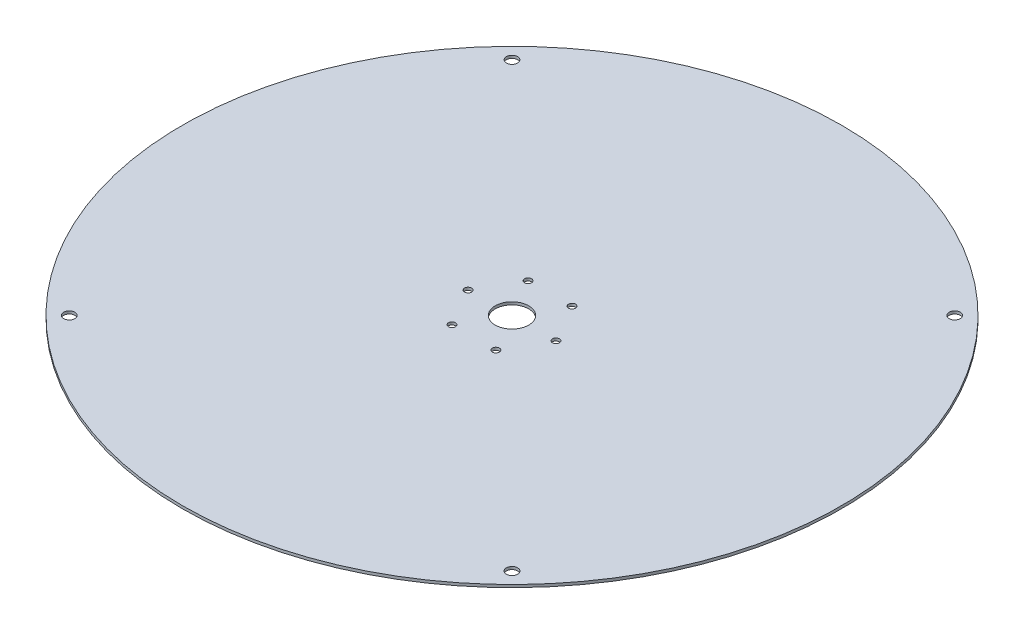
ISO-10303-21;
HEADER;
FILE_DESCRIPTION(('STEP AP214'),'2;1');
FILE_NAME('part.step','',(''),(''),'','','');
FILE_SCHEMA(('AUTOMOTIVE_DESIGN { 1 0 10303 214 1 1 1 1 }'));
ENDSEC;
DATA;
#1=APPLICATION_CONTEXT('core data for automotive mechanical design processes');
#2=APPLICATION_PROTOCOL_DEFINITION('international standard','automotive_design',2000,#1);
#3=PRODUCT_CONTEXT('',#1,'mechanical');
#4=PRODUCT('Part','Part','',(#3));
#5=PRODUCT_RELATED_PRODUCT_CATEGORY('part','',(#4));
#6=PRODUCT_DEFINITION_FORMATION('','',#4);
#7=PRODUCT_DEFINITION_CONTEXT('part definition',#1,'design');
#8=PRODUCT_DEFINITION('design','',#6,#7);
#9=PRODUCT_DEFINITION_SHAPE('','',#8);
#10=(LENGTH_UNIT() NAMED_UNIT(*) SI_UNIT(.MILLI.,.METRE.));
#11=(NAMED_UNIT(*) PLANE_ANGLE_UNIT() SI_UNIT($,.RADIAN.));
#12=(NAMED_UNIT(*) SI_UNIT($,.STERADIAN.) SOLID_ANGLE_UNIT());
#13=UNCERTAINTY_MEASURE_WITH_UNIT(LENGTH_MEASURE(1.E-05),#10,'distance_accuracy_value','');
#14=(GEOMETRIC_REPRESENTATION_CONTEXT(3) GLOBAL_UNCERTAINTY_ASSIGNED_CONTEXT((#13)) GLOBAL_UNIT_ASSIGNED_CONTEXT((#10,
#11,#12)) REPRESENTATION_CONTEXT('',''));
#15=CARTESIAN_POINT('',(0.,0.,0.));
#16=DIRECTION('',(0.,0.,1.));
#17=DIRECTION('',(1.,0.,0.));
#18=AXIS2_PLACEMENT_3D('',#15,#16,#17);
#19=CARTESIAN_POINT('',(0.,3.1,0.));
#20=DIRECTION('',(0.,-1.,0.));
#21=DIRECTION('',(0.,0.,-1.));
#22=AXIS2_PLACEMENT_3D('',#19,#20,#21);
#23=CYLINDRICAL_SURFACE('',#22,375.);
#24=CARTESIAN_POINT('',(0.,3.1,0.));
#25=DIRECTION('',(0.,1.,0.));
#26=DIRECTION('',(0.,0.,1.));
#27=AXIS2_PLACEMENT_3D('',#24,#25,#26);
#28=CIRCLE('',#27,375.);
#29=CARTESIAN_POINT('',(0.,3.1,375.));
#30=VERTEX_POINT('',#29);
#31=EDGE_CURVE('E10',#30,#30,#28,.T.);
#32=ORIENTED_EDGE('',*,*,#31,.F.);
#33=EDGE_LOOP('',(#32));
#34=FACE_BOUND('',#33,.T.);
#35=CARTESIAN_POINT('',(0.,0.,0.));
#36=DIRECTION('',(0.,1.,0.));
#37=DIRECTION('',(0.,0.,1.));
#38=AXIS2_PLACEMENT_3D('',#35,#36,#37);
#39=CIRCLE('',#38,375.);
#40=CARTESIAN_POINT('',(0.,0.,375.));
#41=VERTEX_POINT('',#40);
#42=EDGE_CURVE('E46',#41,#41,#39,.T.);
#43=ORIENTED_EDGE('',*,*,#42,.T.);
#44=EDGE_LOOP('',(#43));
#45=FACE_BOUND('',#44,.T.);
#46=ADVANCED_FACE('F43',(#34,#45),#23,.T.);
#47=CARTESIAN_POINT('',(0.,3.1,0.));
#48=DIRECTION('',(0.,1.,0.));
#49=DIRECTION('',(0.,0.,1.));
#50=AXIS2_PLACEMENT_3D('',#47,#48,#49);
#51=PLANE('',#50);
#52=CARTESIAN_POINT('',(50.,3.1,0.));
#53=DIRECTION('',(0.,1.,0.));
#54=DIRECTION('',(0.,0.,1.));
#55=AXIS2_PLACEMENT_3D('',#52,#53,#54);
#56=CIRCLE('',#55,4.00000000000001);
#57=CARTESIAN_POINT('',(50.,3.1,4.00000000000001));
#58=VERTEX_POINT('',#57);
#59=EDGE_CURVE('E130',#58,#58,#56,.T.);
#60=ORIENTED_EDGE('',*,*,#59,.F.);
#61=EDGE_LOOP('',(#60));
#62=FACE_BOUND('',#61,.T.);
#63=CARTESIAN_POINT('',(25.0000000000005,3.1,-43.3012701892216));
#64=DIRECTION('',(0.,1.,0.));
#65=DIRECTION('',(0.,0.,1.));
#66=AXIS2_PLACEMENT_3D('',#63,#64,#65);
#67=CIRCLE('',#66,4.00000000000001);
#68=CARTESIAN_POINT('',(25.0000000000005,3.1,-39.3012701892216));
#69=VERTEX_POINT('',#68);
#70=EDGE_CURVE('E102',#69,#69,#67,.T.);
#71=ORIENTED_EDGE('',*,*,#70,.F.);
#72=EDGE_LOOP('',(#71));
#73=FACE_BOUND('',#72,.T.);
#74=CARTESIAN_POINT('',(-24.9999999999996,3.1,-43.3012701892222));
#75=DIRECTION('',(0.,1.,0.));
#76=DIRECTION('',(0.,0.,1.));
#77=AXIS2_PLACEMENT_3D('',#74,#75,#76);
#78=CIRCLE('',#77,4.);
#79=CARTESIAN_POINT('',(-24.9999999999996,3.1,-39.3012701892222));
#80=VERTEX_POINT('',#79);
#81=EDGE_CURVE('E101',#80,#80,#78,.T.);
#82=ORIENTED_EDGE('',*,*,#81,.F.);
#83=EDGE_LOOP('',(#82));
#84=FACE_BOUND('',#83,.T.);
#85=CARTESIAN_POINT('',(-50.,3.1,-3.49148133884313E-13));
#86=DIRECTION('',(0.,1.,0.));
#87=DIRECTION('',(0.,0.,1.));
#88=AXIS2_PLACEMENT_3D('',#85,#86,#87);
#89=CIRCLE('',#88,4.00000000000001);
#90=CARTESIAN_POINT('',(-50.,3.1,3.99999999999966));
#91=VERTEX_POINT('',#90);
#92=EDGE_CURVE('E110',#91,#91,#89,.T.);
#93=ORIENTED_EDGE('',*,*,#92,.F.);
#94=EDGE_LOOP('',(#93));
#95=FACE_BOUND('',#94,.T.);
#96=CARTESIAN_POINT('',(-25.0000000000002,3.1,43.3012701892218));
#97=DIRECTION('',(0.,1.,0.));
#98=DIRECTION('',(0.,0.,1.));
#99=AXIS2_PLACEMENT_3D('',#96,#97,#98);
#100=CIRCLE('',#99,4.00000000000001);
#101=CARTESIAN_POINT('',(-25.0000000000002,3.1,47.3012701892218));
#102=VERTEX_POINT('',#101);
#103=EDGE_CURVE('E118',#102,#102,#100,.T.);
#104=ORIENTED_EDGE('',*,*,#103,.F.);
#105=EDGE_LOOP('',(#104));
#106=FACE_BOUND('',#105,.T.);
#107=CARTESIAN_POINT('',(24.9999999999999,3.1,43.301270189222));
#108=DIRECTION('',(0.,1.,0.));
#109=DIRECTION('',(0.,0.,1.));
#110=AXIS2_PLACEMENT_3D('',#107,#108,#109);
#111=CIRCLE('',#110,4.00000000000001);
#112=CARTESIAN_POINT('',(24.9999999999999,3.1,47.301270189222));
#113=VERTEX_POINT('',#112);
#114=EDGE_CURVE('E126',#113,#113,#111,.T.);
#115=ORIENTED_EDGE('',*,*,#114,.F.);
#116=EDGE_LOOP('',(#115));
#117=FACE_BOUND('',#116,.T.);
#118=CARTESIAN_POINT('',(251.871435458645,3.1,251.871435458651));
#119=DIRECTION('',(0.,1.,0.));
#120=DIRECTION('',(0.,0.,1.));
#121=AXIS2_PLACEMENT_3D('',#118,#119,#120);
#122=CIRCLE('',#121,6.35000000000001);
#123=CARTESIAN_POINT('',(251.871435458645,3.1,258.221435458651));
#124=VERTEX_POINT('',#123);
#125=EDGE_CURVE('E69',#124,#124,#122,.T.);
#126=ORIENTED_EDGE('',*,*,#125,.F.);
#127=EDGE_LOOP('',(#126));
#128=FACE_BOUND('',#127,.T.);
#129=CARTESIAN_POINT('',(251.87143545865,3.1,-251.871435458646));
#130=DIRECTION('',(0.,1.,0.));
#131=DIRECTION('',(0.,0.,1.));
#132=AXIS2_PLACEMENT_3D('',#129,#130,#131);
#133=CIRCLE('',#132,6.35);
#134=CARTESIAN_POINT('',(251.87143545865,3.1,-245.521435458646));
#135=VERTEX_POINT('',#134);
#136=EDGE_CURVE('E78',#135,#135,#133,.T.);
#137=ORIENTED_EDGE('',*,*,#136,.F.);
#138=EDGE_LOOP('',(#137));
#139=FACE_BOUND('',#138,.T.);
#140=CARTESIAN_POINT('',(-251.871435458647,3.1,-251.87143545865));
#141=DIRECTION('',(0.,1.,0.));
#142=DIRECTION('',(0.,0.,1.));
#143=AXIS2_PLACEMENT_3D('',#140,#141,#142);
#144=CIRCLE('',#143,6.34999999999998);
#145=CARTESIAN_POINT('',(-251.871435458647,3.1,-245.52143545865));
#146=VERTEX_POINT('',#145);
#147=EDGE_CURVE('E86',#146,#146,#144,.T.);
#148=ORIENTED_EDGE('',*,*,#147,.F.);
#149=EDGE_LOOP('',(#148));
#150=FACE_BOUND('',#149,.T.);
#151=CARTESIAN_POINT('',(0.,3.1,0.));
#152=DIRECTION('',(0.,1.,0.));
#153=DIRECTION('',(0.,0.,1.));
#154=AXIS2_PLACEMENT_3D('',#151,#152,#153);
#155=CIRCLE('',#154,19.05);
#156=CARTESIAN_POINT('',(0.,3.1,19.05));
#157=VERTEX_POINT('',#156);
#158=EDGE_CURVE('E61',#157,#157,#155,.T.);
#159=ORIENTED_EDGE('',*,*,#158,.F.);
#160=EDGE_LOOP('',(#159));
#161=FACE_BOUND('',#160,.T.);
#162=CARTESIAN_POINT('',(-251.871435458649,3.1,251.871435458648));
#163=DIRECTION('',(0.,1.,0.));
#164=DIRECTION('',(0.,0.,1.));
#165=AXIS2_PLACEMENT_3D('',#162,#163,#164);
#166=CIRCLE('',#165,6.34999999999999);
#167=CARTESIAN_POINT('',(-251.871435458649,3.1,258.221435458648));
#168=VERTEX_POINT('',#167);
#169=EDGE_CURVE('E57',#168,#168,#166,.T.);
#170=ORIENTED_EDGE('',*,*,#169,.F.);
#171=EDGE_LOOP('',(#170));
#172=FACE_BOUND('',#171,.T.);
#173=ORIENTED_EDGE('',*,*,#31,.T.);
#174=EDGE_LOOP('',(#173));
#175=FACE_BOUND('',#174,.T.);
#176=ADVANCED_FACE('F155',(#62,#73,#84,#95,#106,#117,#128,#139,#150,#161,#172,#175),#51,.T.);
#177=CARTESIAN_POINT('',(0.,0.,0.));
#178=DIRECTION('',(0.,1.,0.));
#179=DIRECTION('',(0.,0.,1.));
#180=AXIS2_PLACEMENT_3D('',#177,#178,#179);
#181=PLANE('',#180);
#182=CARTESIAN_POINT('',(50.,0.,0.));
#183=DIRECTION('',(0.,1.,0.));
#184=DIRECTION('',(0.,0.,1.));
#185=AXIS2_PLACEMENT_3D('',#182,#183,#184);
#186=CIRCLE('',#185,4.00000000000001);
#187=CARTESIAN_POINT('',(50.,0.,4.00000000000001));
#188=VERTEX_POINT('',#187);
#189=EDGE_CURVE('E70',#188,#188,#186,.T.);
#190=ORIENTED_EDGE('',*,*,#189,.T.);
#191=EDGE_LOOP('',(#190));
#192=FACE_BOUND('',#191,.T.);
#193=CARTESIAN_POINT('',(25.0000000000005,0.,-43.3012701892216));
#194=DIRECTION('',(0.,1.,0.));
#195=DIRECTION('',(0.,0.,1.));
#196=AXIS2_PLACEMENT_3D('',#193,#194,#195);
#197=CIRCLE('',#196,4.00000000000001);
#198=CARTESIAN_POINT('',(25.0000000000005,0.,-39.3012701892216));
#199=VERTEX_POINT('',#198);
#200=EDGE_CURVE('E131',#199,#199,#197,.T.);
#201=ORIENTED_EDGE('',*,*,#200,.T.);
#202=EDGE_LOOP('',(#201));
#203=FACE_BOUND('',#202,.T.);
#204=CARTESIAN_POINT('',(-24.9999999999996,0.,-43.3012701892222));
#205=DIRECTION('',(0.,1.,0.));
#206=DIRECTION('',(0.,0.,1.));
#207=AXIS2_PLACEMENT_3D('',#204,#205,#206);
#208=CIRCLE('',#207,4.);
#209=CARTESIAN_POINT('',(-24.9999999999996,0.,-39.3012701892222));
#210=VERTEX_POINT('',#209);
#211=EDGE_CURVE('E97',#210,#210,#208,.T.);
#212=ORIENTED_EDGE('',*,*,#211,.T.);
#213=EDGE_LOOP('',(#212));
#214=FACE_BOUND('',#213,.T.);
#215=CARTESIAN_POINT('',(-50.,0.,-3.49148133884313E-13));
#216=DIRECTION('',(0.,1.,0.));
#217=DIRECTION('',(0.,0.,1.));
#218=AXIS2_PLACEMENT_3D('',#215,#216,#217);
#219=CIRCLE('',#218,4.00000000000001);
#220=CARTESIAN_POINT('',(-50.,0.,3.99999999999966));
#221=VERTEX_POINT('',#220);
#222=EDGE_CURVE('E106',#221,#221,#219,.T.);
#223=ORIENTED_EDGE('',*,*,#222,.T.);
#224=EDGE_LOOP('',(#223));
#225=FACE_BOUND('',#224,.T.);
#226=CARTESIAN_POINT('',(-25.0000000000002,0.,43.3012701892218));
#227=DIRECTION('',(0.,1.,0.));
#228=DIRECTION('',(0.,0.,1.));
#229=AXIS2_PLACEMENT_3D('',#226,#227,#228);
#230=CIRCLE('',#229,4.00000000000001);
#231=CARTESIAN_POINT('',(-25.0000000000002,0.,47.3012701892218));
#232=VERTEX_POINT('',#231);
#233=EDGE_CURVE('E114',#232,#232,#230,.T.);
#234=ORIENTED_EDGE('',*,*,#233,.T.);
#235=EDGE_LOOP('',(#234));
#236=FACE_BOUND('',#235,.T.);
#237=CARTESIAN_POINT('',(24.9999999999999,0.,43.301270189222));
#238=DIRECTION('',(0.,1.,0.));
#239=DIRECTION('',(0.,0.,1.));
#240=AXIS2_PLACEMENT_3D('',#237,#238,#239);
#241=CIRCLE('',#240,4.00000000000001);
#242=CARTESIAN_POINT('',(24.9999999999999,0.,47.301270189222));
#243=VERTEX_POINT('',#242);
#244=EDGE_CURVE('E122',#243,#243,#241,.T.);
#245=ORIENTED_EDGE('',*,*,#244,.T.);
#246=EDGE_LOOP('',(#245));
#247=FACE_BOUND('',#246,.T.);
#248=CARTESIAN_POINT('',(251.871435458645,0.,251.871435458651));
#249=DIRECTION('',(0.,1.,0.));
#250=DIRECTION('',(0.,0.,1.));
#251=AXIS2_PLACEMENT_3D('',#248,#249,#250);
#252=CIRCLE('',#251,6.35000000000001);
#253=CARTESIAN_POINT('',(251.871435458645,0.,258.221435458651));
#254=VERTEX_POINT('',#253);
#255=EDGE_CURVE('E65',#254,#254,#252,.T.);
#256=ORIENTED_EDGE('',*,*,#255,.T.);
#257=EDGE_LOOP('',(#256));
#258=FACE_BOUND('',#257,.T.);
#259=CARTESIAN_POINT('',(251.87143545865,0.,-251.871435458646));
#260=DIRECTION('',(0.,1.,0.));
#261=DIRECTION('',(0.,0.,1.));
#262=AXIS2_PLACEMENT_3D('',#259,#260,#261);
#263=CIRCLE('',#262,6.35);
#264=CARTESIAN_POINT('',(251.87143545865,0.,-245.521435458646));
#265=VERTEX_POINT('',#264);
#266=EDGE_CURVE('E74',#265,#265,#263,.T.);
#267=ORIENTED_EDGE('',*,*,#266,.T.);
#268=EDGE_LOOP('',(#267));
#269=FACE_BOUND('',#268,.T.);
#270=CARTESIAN_POINT('',(-251.871435458647,0.,-251.87143545865));
#271=DIRECTION('',(0.,1.,0.));
#272=DIRECTION('',(0.,0.,1.));
#273=AXIS2_PLACEMENT_3D('',#270,#271,#272);
#274=CIRCLE('',#273,6.34999999999998);
#275=CARTESIAN_POINT('',(-251.871435458647,0.,-245.52143545865));
#276=VERTEX_POINT('',#275);
#277=EDGE_CURVE('E82',#276,#276,#274,.T.);
#278=ORIENTED_EDGE('',*,*,#277,.T.);
#279=EDGE_LOOP('',(#278));
#280=FACE_BOUND('',#279,.T.);
#281=CARTESIAN_POINT('',(0.,0.,0.));
#282=DIRECTION('',(0.,1.,0.));
#283=DIRECTION('',(0.,0.,1.));
#284=AXIS2_PLACEMENT_3D('',#281,#282,#283);
#285=CIRCLE('',#284,19.05);
#286=CARTESIAN_POINT('',(0.,0.,19.05));
#287=VERTEX_POINT('',#286);
#288=EDGE_CURVE('E90',#287,#287,#285,.T.);
#289=ORIENTED_EDGE('',*,*,#288,.T.);
#290=EDGE_LOOP('',(#289));
#291=FACE_BOUND('',#290,.T.);
#292=CARTESIAN_POINT('',(-251.871435458649,0.,251.871435458648));
#293=DIRECTION('',(0.,1.,0.));
#294=DIRECTION('',(0.,0.,1.));
#295=AXIS2_PLACEMENT_3D('',#292,#293,#294);
#296=CIRCLE('',#295,6.34999999999999);
#297=CARTESIAN_POINT('',(-251.871435458649,0.,258.221435458648));
#298=VERTEX_POINT('',#297);
#299=EDGE_CURVE('E55',#298,#298,#296,.T.);
#300=ORIENTED_EDGE('',*,*,#299,.T.);
#301=EDGE_LOOP('',(#300));
#302=FACE_BOUND('',#301,.T.);
#303=ORIENTED_EDGE('',*,*,#42,.F.);
#304=EDGE_LOOP('',(#303));
#305=FACE_BOUND('',#304,.T.);
#306=ADVANCED_FACE('F145',(#192,#203,#214,#225,#236,#247,#258,#269,#280,#291,#302,#305),#181,.F.);
#307=CARTESIAN_POINT('',(-251.871435458649,0.,251.871435458648));
#308=DIRECTION('',(0.,1.,0.));
#309=DIRECTION('',(0.,0.,1.));
#310=AXIS2_PLACEMENT_3D('',#307,#308,#309);
#311=CYLINDRICAL_SURFACE('',#310,6.34999999999999);
#312=ORIENTED_EDGE('',*,*,#299,.F.);
#313=EDGE_LOOP('',(#312));
#314=FACE_BOUND('',#313,.T.);
#315=ORIENTED_EDGE('',*,*,#169,.T.);
#316=EDGE_LOOP('',(#315));
#317=FACE_BOUND('',#316,.T.);
#318=ADVANCED_FACE('F179',(#314,#317),#311,.F.);
#319=CARTESIAN_POINT('',(0.,0.,0.));
#320=DIRECTION('',(0.,1.,0.));
#321=DIRECTION('',(0.,0.,1.));
#322=AXIS2_PLACEMENT_3D('',#319,#320,#321);
#323=CYLINDRICAL_SURFACE('',#322,19.05);
#324=ORIENTED_EDGE('',*,*,#288,.F.);
#325=EDGE_LOOP('',(#324));
#326=FACE_BOUND('',#325,.T.);
#327=ORIENTED_EDGE('',*,*,#158,.T.);
#328=EDGE_LOOP('',(#327));
#329=FACE_BOUND('',#328,.T.);
#330=ADVANCED_FACE('F181',(#326,#329),#323,.F.);
#331=CARTESIAN_POINT('',(-251.871435458647,0.,-251.87143545865));
#332=DIRECTION('',(0.,1.,0.));
#333=DIRECTION('',(0.,0.,1.));
#334=AXIS2_PLACEMENT_3D('',#331,#332,#333);
#335=CYLINDRICAL_SURFACE('',#334,6.34999999999998);
#336=ORIENTED_EDGE('',*,*,#277,.F.);
#337=EDGE_LOOP('',(#336));
#338=FACE_BOUND('',#337,.T.);
#339=ORIENTED_EDGE('',*,*,#147,.T.);
#340=EDGE_LOOP('',(#339));
#341=FACE_BOUND('',#340,.T.);
#342=ADVANCED_FACE('F188',(#338,#341),#335,.F.);
#343=CARTESIAN_POINT('',(251.87143545865,0.,-251.871435458646));
#344=DIRECTION('',(0.,1.,0.));
#345=DIRECTION('',(0.,0.,1.));
#346=AXIS2_PLACEMENT_3D('',#343,#344,#345);
#347=CYLINDRICAL_SURFACE('',#346,6.35);
#348=ORIENTED_EDGE('',*,*,#266,.F.);
#349=EDGE_LOOP('',(#348));
#350=FACE_BOUND('',#349,.T.);
#351=ORIENTED_EDGE('',*,*,#136,.T.);
#352=EDGE_LOOP('',(#351));
#353=FACE_BOUND('',#352,.T.);
#354=ADVANCED_FACE('F234',(#350,#353),#347,.F.);
#355=CARTESIAN_POINT('',(251.871435458645,0.,251.871435458651));
#356=DIRECTION('',(0.,1.,0.));
#357=DIRECTION('',(0.,0.,1.));
#358=AXIS2_PLACEMENT_3D('',#355,#356,#357);
#359=CYLINDRICAL_SURFACE('',#358,6.35000000000001);
#360=ORIENTED_EDGE('',*,*,#255,.F.);
#361=EDGE_LOOP('',(#360));
#362=FACE_BOUND('',#361,.T.);
#363=ORIENTED_EDGE('',*,*,#125,.T.);
#364=EDGE_LOOP('',(#363));
#365=FACE_BOUND('',#364,.T.);
#366=ADVANCED_FACE('F244',(#362,#365),#359,.F.);
#367=CARTESIAN_POINT('',(24.9999999999999,0.,43.301270189222));
#368=DIRECTION('',(0.,1.,0.));
#369=DIRECTION('',(0.,0.,1.));
#370=AXIS2_PLACEMENT_3D('',#367,#368,#369);
#371=CYLINDRICAL_SURFACE('',#370,4.00000000000001);
#372=ORIENTED_EDGE('',*,*,#244,.F.);
#373=EDGE_LOOP('',(#372));
#374=FACE_BOUND('',#373,.T.);
#375=ORIENTED_EDGE('',*,*,#114,.T.);
#376=EDGE_LOOP('',(#375));
#377=FACE_BOUND('',#376,.T.);
#378=ADVANCED_FACE('F253',(#374,#377),#371,.F.);
#379=CARTESIAN_POINT('',(-25.0000000000002,0.,43.3012701892218));
#380=DIRECTION('',(0.,1.,0.));
#381=DIRECTION('',(0.,0.,1.));
#382=AXIS2_PLACEMENT_3D('',#379,#380,#381);
#383=CYLINDRICAL_SURFACE('',#382,4.00000000000001);
#384=ORIENTED_EDGE('',*,*,#233,.F.);
#385=EDGE_LOOP('',(#384));
#386=FACE_BOUND('',#385,.T.);
#387=ORIENTED_EDGE('',*,*,#103,.T.);
#388=EDGE_LOOP('',(#387));
#389=FACE_BOUND('',#388,.T.);
#390=ADVANCED_FACE('F261',(#386,#389),#383,.F.);
#391=CARTESIAN_POINT('',(-50.,0.,-3.49148133884313E-13));
#392=DIRECTION('',(0.,1.,0.));
#393=DIRECTION('',(0.,0.,1.));
#394=AXIS2_PLACEMENT_3D('',#391,#392,#393);
#395=CYLINDRICAL_SURFACE('',#394,4.00000000000001);
#396=ORIENTED_EDGE('',*,*,#222,.F.);
#397=EDGE_LOOP('',(#396));
#398=FACE_BOUND('',#397,.T.);
#399=ORIENTED_EDGE('',*,*,#92,.T.);
#400=EDGE_LOOP('',(#399));
#401=FACE_BOUND('',#400,.T.);
#402=ADVANCED_FACE('F271',(#398,#401),#395,.F.);
#403=CARTESIAN_POINT('',(-24.9999999999996,0.,-43.3012701892222));
#404=DIRECTION('',(0.,1.,0.));
#405=DIRECTION('',(0.,0.,1.));
#406=AXIS2_PLACEMENT_3D('',#403,#404,#405);
#407=CYLINDRICAL_SURFACE('',#406,4.);
#408=ORIENTED_EDGE('',*,*,#211,.F.);
#409=EDGE_LOOP('',(#408));
#410=FACE_BOUND('',#409,.T.);
#411=ORIENTED_EDGE('',*,*,#81,.T.);
#412=EDGE_LOOP('',(#411));
#413=FACE_BOUND('',#412,.T.);
#414=ADVANCED_FACE('F281',(#410,#413),#407,.F.);
#415=CARTESIAN_POINT('',(25.0000000000005,0.,-43.3012701892216));
#416=DIRECTION('',(0.,1.,0.));
#417=DIRECTION('',(0.,0.,1.));
#418=AXIS2_PLACEMENT_3D('',#415,#416,#417);
#419=CYLINDRICAL_SURFACE('',#418,4.00000000000001);
#420=ORIENTED_EDGE('',*,*,#200,.F.);
#421=EDGE_LOOP('',(#420));
#422=FACE_BOUND('',#421,.T.);
#423=ORIENTED_EDGE('',*,*,#70,.T.);
#424=EDGE_LOOP('',(#423));
#425=FACE_BOUND('',#424,.T.);
#426=ADVANCED_FACE('F151',(#422,#425),#419,.F.);
#427=CARTESIAN_POINT('',(50.,0.,0.));
#428=DIRECTION('',(0.,1.,0.));
#429=DIRECTION('',(0.,0.,1.));
#430=AXIS2_PLACEMENT_3D('',#427,#428,#429);
#431=CYLINDRICAL_SURFACE('',#430,4.00000000000001);
#432=ORIENTED_EDGE('',*,*,#189,.F.);
#433=EDGE_LOOP('',(#432));
#434=FACE_BOUND('',#433,.T.);
#435=ORIENTED_EDGE('',*,*,#59,.T.);
#436=EDGE_LOOP('',(#435));
#437=FACE_BOUND('',#436,.T.);
#438=ADVANCED_FACE('F148',(#434,#437),#431,.F.);
#439=CLOSED_SHELL('',(#46,#176,#306,#318,#330,#342,#354,#366,#378,#390,#402,#414,#426,#438));
#440=MANIFOLD_SOLID_BREP('B2',#439);
#441=ADVANCED_BREP_SHAPE_REPRESENTATION('',(#18,#440),#14);
#442=SHAPE_DEFINITION_REPRESENTATION(#9,#441);
ENDSEC;
END-ISO-10303-21;
